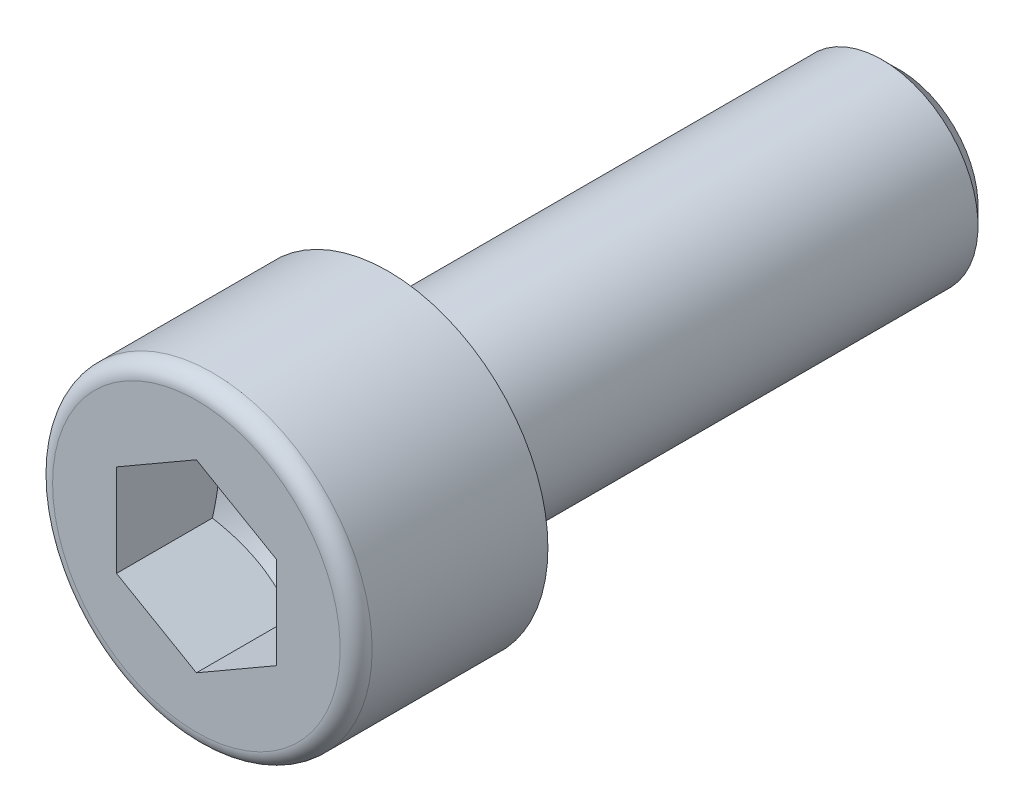
ISO-10303-21;
HEADER;
FILE_DESCRIPTION(('STEP AP214'),'2;1');
FILE_NAME('part.step','',(''),(''),'','','');
FILE_SCHEMA(('AUTOMOTIVE_DESIGN { 1 0 10303 214 1 1 1 1 }'));
ENDSEC;
DATA;
#1=APPLICATION_CONTEXT('core data for automotive mechanical design processes');
#2=APPLICATION_PROTOCOL_DEFINITION('international standard','automotive_design',2000,#1);
#3=PRODUCT_CONTEXT('',#1,'mechanical');
#4=PRODUCT('Part','Part','',(#3));
#5=PRODUCT_RELATED_PRODUCT_CATEGORY('part','',(#4));
#6=PRODUCT_DEFINITION_FORMATION('','',#4);
#7=PRODUCT_DEFINITION_CONTEXT('part definition',#1,'design');
#8=PRODUCT_DEFINITION('design','',#6,#7);
#9=PRODUCT_DEFINITION_SHAPE('','',#8);
#10=(LENGTH_UNIT() NAMED_UNIT(*) SI_UNIT(.MILLI.,.METRE.));
#11=(NAMED_UNIT(*) PLANE_ANGLE_UNIT() SI_UNIT($,.RADIAN.));
#12=(NAMED_UNIT(*) SI_UNIT($,.STERADIAN.) SOLID_ANGLE_UNIT());
#13=UNCERTAINTY_MEASURE_WITH_UNIT(LENGTH_MEASURE(1.E-05),#10,'distance_accuracy_value','');
#14=(GEOMETRIC_REPRESENTATION_CONTEXT(3) GLOBAL_UNCERTAINTY_ASSIGNED_CONTEXT((#13)) GLOBAL_UNIT_ASSIGNED_CONTEXT((#10,
#11,#12)) REPRESENTATION_CONTEXT('',''));
#15=CARTESIAN_POINT('',(0.,0.,0.));
#16=DIRECTION('',(0.,0.,1.));
#17=DIRECTION('',(1.,0.,0.));
#18=AXIS2_PLACEMENT_3D('',#15,#16,#17);
#19=CARTESIAN_POINT('',(-2.5,0.,0.));
#20=DIRECTION('',(0.,0.,-1.));
#21=DIRECTION('',(-1.,0.,0.));
#22=AXIS2_PLACEMENT_3D('',#19,#20,#21);
#23=PLANE('',#22);
#24=CARTESIAN_POINT('',(0.,0.,0.));
#25=DIRECTION('',(0.,0.,-1.));
#26=DIRECTION('',(-1.,0.,0.));
#27=AXIS2_PLACEMENT_3D('',#24,#25,#26);
#28=CIRCLE('',#27,5.);
#29=CARTESIAN_POINT('',(-5.,0.,0.));
#30=VERTEX_POINT('',#29);
#31=EDGE_CURVE('E11',#30,#30,#28,.T.);
#32=ORIENTED_EDGE('',*,*,#31,.T.);
#33=EDGE_LOOP('',(#32));
#34=FACE_BOUND('',#33,.T.);
#35=CARTESIAN_POINT('',(0.,0.,0.));
#36=DIRECTION('',(0.,0.,1.));
#37=DIRECTION('',(-1.,0.,0.));
#38=AXIS2_PLACEMENT_3D('',#35,#36,#37);
#39=CIRCLE('',#38,3.);
#40=CARTESIAN_POINT('',(3.,0.,0.));
#41=VERTEX_POINT('',#40);
#42=EDGE_CURVE('E142',#41,#41,#39,.T.);
#43=ORIENTED_EDGE('',*,*,#42,.T.);
#44=EDGE_LOOP('',(#43));
#45=FACE_BOUND('',#44,.T.);
#46=ADVANCED_FACE('F16',(#34,#45),#23,.T.);
#47=CARTESIAN_POINT('',(0.,0.,2.75));
#48=DIRECTION('',(0.,0.,1.));
#49=DIRECTION('',(-1.,0.,0.));
#50=AXIS2_PLACEMENT_3D('',#47,#48,#49);
#51=CYLINDRICAL_SURFACE('',#50,5.);
#52=CARTESIAN_POINT('',(0.,0.,5.5));
#53=DIRECTION('',(0.,0.,-1.));
#54=DIRECTION('',(-1.,0.,0.));
#55=AXIS2_PLACEMENT_3D('',#52,#53,#54);
#56=CIRCLE('',#55,5.);
#57=CARTESIAN_POINT('',(-5.,0.,5.5));
#58=VERTEX_POINT('',#57);
#59=EDGE_CURVE('E26',#58,#58,#56,.T.);
#60=ORIENTED_EDGE('',*,*,#59,.T.);
#61=EDGE_LOOP('',(#60));
#62=FACE_BOUND('',#61,.T.);
#63=ORIENTED_EDGE('',*,*,#31,.F.);
#64=EDGE_LOOP('',(#63));
#65=FACE_BOUND('',#64,.T.);
#66=ADVANCED_FACE('F18',(#62,#65),#51,.T.);
#67=CARTESIAN_POINT('',(0.,0.,5.5));
#68=DIRECTION('',(0.,0.,-1.));
#69=DIRECTION('',(0.,-1.,0.));
#70=AXIS2_PLACEMENT_3D('',#67,#68,#69);
#71=TOROIDAL_SURFACE('',#70,4.5,0.5);
#72=CARTESIAN_POINT('',(0.,0.,6.));
#73=DIRECTION('',(0.,0.,-1.));
#74=DIRECTION('',(-1.,0.,0.));
#75=AXIS2_PLACEMENT_3D('',#72,#73,#74);
#76=CIRCLE('',#75,4.5);
#77=CARTESIAN_POINT('',(-4.5,0.,6.));
#78=VERTEX_POINT('',#77);
#79=EDGE_CURVE('E141',#78,#78,#76,.T.);
#80=ORIENTED_EDGE('',*,*,#79,.T.);
#81=EDGE_LOOP('',(#80));
#82=FACE_BOUND('',#81,.T.);
#83=ORIENTED_EDGE('',*,*,#59,.F.);
#84=EDGE_LOOP('',(#83));
#85=FACE_BOUND('',#84,.T.);
#86=ADVANCED_FACE('F207',(#82,#85),#71,.T.);
#87=CARTESIAN_POINT('',(-2.25,0.,6.));
#88=DIRECTION('',(0.,0.,1.));
#89=DIRECTION('',(1.,0.,0.));
#90=AXIS2_PLACEMENT_3D('',#87,#88,#89);
#91=PLANE('',#90);
#92=ORIENTED_EDGE('',*,*,#79,.F.);
#93=EDGE_LOOP('',(#92));
#94=FACE_BOUND('',#93,.T.);
#95=DIRECTION('',(-0.866025403784439,-0.5,0.));
#96=VECTOR('',#95,1.);
#97=CARTESIAN_POINT('',(0.406249417187364,-2.65220178962874,6.));
#98=LINE('',#97,#96);
#99=CARTESIAN_POINT('',(2.49999883437473,-1.443375,6.));
#100=VERTEX_POINT('',#99);
#101=CARTESIAN_POINT('',(0.,-2.88675,6.));
#102=VERTEX_POINT('',#101);
#103=EDGE_CURVE('E109',#100,#102,#98,.T.);
#104=ORIENTED_EDGE('',*,*,#103,.T.);
#105=DIRECTION('',(-0.866025403784439,0.5,0.));
#106=VECTOR('',#105,1.);
#107=CARTESIAN_POINT('',(-2.09374941718736,-1.67792321037125,6.));
#108=LINE('',#107,#106);
#109=CARTESIAN_POINT('',(-2.49999883437473,-1.443375,6.));
#110=VERTEX_POINT('',#109);
#111=EDGE_CURVE('E146',#102,#110,#108,.T.);
#112=ORIENTED_EDGE('',*,*,#111,.T.);
#113=DIRECTION('',(0.,1.,0.));
#114=VECTOR('',#113,1.);
#115=CARTESIAN_POINT('',(-2.49999883437473,0.,6.));
#116=LINE('',#115,#114);
#117=CARTESIAN_POINT('',(-2.49999883437473,1.443375,6.));
#118=VERTEX_POINT('',#117);
#119=EDGE_CURVE('E143',#110,#118,#116,.T.);
#120=ORIENTED_EDGE('',*,*,#119,.T.);
#121=DIRECTION('',(0.866025403784439,0.5,0.));
#122=VECTOR('',#121,1.);
#123=CARTESIAN_POINT('',(-2.09374941718736,1.67792321037125,6.));
#124=LINE('',#123,#122);
#125=CARTESIAN_POINT('',(0.,2.88675,6.));
#126=VERTEX_POINT('',#125);
#127=EDGE_CURVE('E91',#118,#126,#124,.T.);
#128=ORIENTED_EDGE('',*,*,#127,.T.);
#129=DIRECTION('',(0.866025403784439,-0.5,0.));
#130=VECTOR('',#129,1.);
#131=CARTESIAN_POINT('',(0.406249417187364,2.65220178962874,6.));
#132=LINE('',#131,#130);
#133=CARTESIAN_POINT('',(2.49999883437473,1.443375,6.));
#134=VERTEX_POINT('',#133);
#135=EDGE_CURVE('E83',#126,#134,#132,.T.);
#136=ORIENTED_EDGE('',*,*,#135,.T.);
#137=DIRECTION('',(0.,-1.,0.));
#138=VECTOR('',#137,1.);
#139=CARTESIAN_POINT('',(2.49999883437473,0.,6.));
#140=LINE('',#139,#138);
#141=EDGE_CURVE('E88',#134,#100,#140,.T.);
#142=ORIENTED_EDGE('',*,*,#141,.T.);
#143=EDGE_LOOP('',(#104,#112,#120,#128,#136,#142));
#144=FACE_BOUND('',#143,.T.);
#145=ADVANCED_FACE('F86',(#94,#144),#91,.T.);
#146=CARTESIAN_POINT('',(-1.229375,0.,-16.));
#147=DIRECTION('',(0.,0.,-1.));
#148=DIRECTION('',(-1.,0.,0.));
#149=AXIS2_PLACEMENT_3D('',#146,#147,#148);
#150=PLANE('',#149);
#151=CARTESIAN_POINT('',(0.,0.,-16.));
#152=DIRECTION('',(0.,0.,-1.));
#153=DIRECTION('',(-1.,0.,0.));
#154=AXIS2_PLACEMENT_3D('',#151,#152,#153);
#155=CIRCLE('',#154,2.45875);
#156=CARTESIAN_POINT('',(-2.45875,0.,-16.));
#157=VERTEX_POINT('',#156);
#158=EDGE_CURVE('E136',#157,#157,#155,.T.);
#159=ORIENTED_EDGE('',*,*,#158,.T.);
#160=EDGE_LOOP('',(#159));
#161=FACE_BOUND('',#160,.T.);
#162=ADVANCED_FACE('F221',(#161),#150,.T.);
#163=CARTESIAN_POINT('',(0.,0.,-15.729375));
#164=DIRECTION('',(0.,0.,1.));
#165=DIRECTION('',(-1.,0.,0.));
#166=AXIS2_PLACEMENT_3D('',#163,#164,#165);
#167=CONICAL_SURFACE('',#166,2.729375,0.785398163397448);
#168=CARTESIAN_POINT('',(0.,0.,-15.45875));
#169=DIRECTION('',(0.,0.,-1.));
#170=DIRECTION('',(-1.,0.,0.));
#171=AXIS2_PLACEMENT_3D('',#168,#169,#170);
#172=CIRCLE('',#171,3.);
#173=CARTESIAN_POINT('',(-3.,0.,-15.45875));
#174=VERTEX_POINT('',#173);
#175=EDGE_CURVE('E20',#174,#174,#172,.T.);
#176=ORIENTED_EDGE('',*,*,#175,.T.);
#177=EDGE_LOOP('',(#176));
#178=FACE_BOUND('',#177,.T.);
#179=ORIENTED_EDGE('',*,*,#158,.F.);
#180=EDGE_LOOP('',(#179));
#181=FACE_BOUND('',#180,.T.);
#182=ADVANCED_FACE('F215',(#178,#181),#167,.T.);
#183=CARTESIAN_POINT('',(0.,0.,-7.229375));
#184=DIRECTION('',(0.,0.,1.));
#185=DIRECTION('',(-1.,0.,0.));
#186=AXIS2_PLACEMENT_3D('',#183,#184,#185);
#187=CYLINDRICAL_SURFACE('',#186,3.);
#188=ORIENTED_EDGE('',*,*,#42,.F.);
#189=EDGE_LOOP('',(#188));
#190=FACE_BOUND('',#189,.T.);
#191=ORIENTED_EDGE('',*,*,#175,.F.);
#192=EDGE_LOOP('',(#191));
#193=FACE_BOUND('',#192,.T.);
#194=ADVANCED_FACE('F212',(#190,#193),#187,.T.);
#195=CARTESIAN_POINT('',(-1.24999941718736,-2.1650625,6.));
#196=DIRECTION('',(-0.5,-0.866025403784439,0.));
#197=DIRECTION('',(-0.866025403784439,0.5,0.));
#198=AXIS2_PLACEMENT_3D('',#195,#196,#197);
#199=PLANE('',#198);
#200=CARTESIAN_POINT('',(0.,-2.88675,3.));
#201=CARTESIAN_POINT('',(-1.24999941718736,-2.1650625,2.58333352760422));
#202=CARTESIAN_POINT('',(-2.49999883437473,-1.443375,3.));
#203=(BOUNDED_CURVE() B_SPLINE_CURVE(2,(#200,#201,#202),.UNSPECIFIED.,.F.,
.F.) B_SPLINE_CURVE_WITH_KNOTS((3,3),(0.,2.92108898323611),
.UNSPECIFIED.) CURVE() GEOMETRIC_REPRESENTATION_ITEM() RATIONAL_B_SPLINE_CURVE((1.,
1.15470053837925,1.)) REPRESENTATION_ITEM(''));
#204=CARTESIAN_POINT('',(0.,-2.88675,3.));
#205=VERTEX_POINT('',#204);
#206=CARTESIAN_POINT('',(-2.49999883437473,-1.443375,3.));
#207=VERTEX_POINT('',#206);
#208=EDGE_CURVE('E118',#205,#207,#203,.T.);
#209=ORIENTED_EDGE('',*,*,#208,.T.);
#210=DIRECTION('',(0.,0.,-1.));
#211=VECTOR('',#210,1.);
#212=CARTESIAN_POINT('',(-2.49999883437473,-1.443375,6.));
#213=LINE('',#212,#211);
#214=EDGE_CURVE('E144',#110,#207,#213,.T.);
#215=ORIENTED_EDGE('',*,*,#214,.F.);
#216=ORIENTED_EDGE('',*,*,#111,.F.);
#217=DIRECTION('',(0.,0.,-1.));
#218=VECTOR('',#217,1.);
#219=CARTESIAN_POINT('',(0.,-2.88675,6.));
#220=LINE('',#219,#218);
#221=EDGE_CURVE('E159',#102,#205,#220,.T.);
#222=ORIENTED_EDGE('',*,*,#221,.T.);
#223=EDGE_LOOP('',(#209,#215,#216,#222));
#224=FACE_BOUND('',#223,.T.);
#225=ADVANCED_FACE('F188',(#224),#199,.F.);
#226=CARTESIAN_POINT('',(-2.49999883437473,0.,6.));
#227=DIRECTION('',(-1.,0.,0.));
#228=DIRECTION('',(0.,1.,0.));
#229=AXIS2_PLACEMENT_3D('',#226,#227,#228);
#230=PLANE('',#229);
#231=CARTESIAN_POINT('',(-2.49999883437473,-1.443375,3.));
#232=CARTESIAN_POINT('',(-2.49999883437473,0.,2.58333352760421));
#233=CARTESIAN_POINT('',(-2.49999883437473,1.443375,3.));
#234=(BOUNDED_CURVE() B_SPLINE_CURVE(2,(#231,#232,#233),.UNSPECIFIED.,.F.,
.F.) B_SPLINE_CURVE_WITH_KNOTS((3,3),(0.,2.92108898323611),
.UNSPECIFIED.) CURVE() GEOMETRIC_REPRESENTATION_ITEM() RATIONAL_B_SPLINE_CURVE((1.,
1.15470053837925,1.)) REPRESENTATION_ITEM(''));
#235=CARTESIAN_POINT('',(-2.49999883437473,1.443375,3.));
#236=VERTEX_POINT('',#235);
#237=EDGE_CURVE('E113',#207,#236,#234,.T.);
#238=ORIENTED_EDGE('',*,*,#237,.T.);
#239=DIRECTION('',(0.,0.,-1.));
#240=VECTOR('',#239,1.);
#241=CARTESIAN_POINT('',(-2.49999883437473,1.443375,6.));
#242=LINE('',#241,#240);
#243=EDGE_CURVE('E145',#118,#236,#242,.T.);
#244=ORIENTED_EDGE('',*,*,#243,.F.);
#245=ORIENTED_EDGE('',*,*,#119,.F.);
#246=ORIENTED_EDGE('',*,*,#214,.T.);
#247=EDGE_LOOP('',(#238,#244,#245,#246));
#248=FACE_BOUND('',#247,.T.);
#249=ADVANCED_FACE('F190',(#248),#230,.F.);
#250=CARTESIAN_POINT('',(-1.24999941718736,2.1650625,6.));
#251=DIRECTION('',(-0.5,0.866025403784439,0.));
#252=DIRECTION('',(0.866025403784439,0.5,0.));
#253=AXIS2_PLACEMENT_3D('',#250,#251,#252);
#254=PLANE('',#253);
#255=CARTESIAN_POINT('',(-2.49999883437473,1.443375,3.));
#256=CARTESIAN_POINT('',(-1.24999941718736,2.1650625,2.58333352760421));
#257=CARTESIAN_POINT('',(0.,2.88675,3.));
#258=(BOUNDED_CURVE() B_SPLINE_CURVE(2,(#255,#256,#257),.UNSPECIFIED.,.F.,
.F.) B_SPLINE_CURVE_WITH_KNOTS((3,3),(0.,2.9210889832361),
.UNSPECIFIED.) CURVE() GEOMETRIC_REPRESENTATION_ITEM() RATIONAL_B_SPLINE_CURVE((1.,
1.15470053837926,1.)) REPRESENTATION_ITEM(''));
#259=CARTESIAN_POINT('',(0.,2.88675,3.));
#260=VERTEX_POINT('',#259);
#261=EDGE_CURVE('E119',#236,#260,#258,.T.);
#262=ORIENTED_EDGE('',*,*,#261,.T.);
#263=DIRECTION('',(0.,0.,-1.));
#264=VECTOR('',#263,1.);
#265=CARTESIAN_POINT('',(0.,2.88675,6.));
#266=LINE('',#265,#264);
#267=EDGE_CURVE('E94',#126,#260,#266,.T.);
#268=ORIENTED_EDGE('',*,*,#267,.F.);
#269=ORIENTED_EDGE('',*,*,#127,.F.);
#270=ORIENTED_EDGE('',*,*,#243,.T.);
#271=EDGE_LOOP('',(#262,#268,#269,#270));
#272=FACE_BOUND('',#271,.T.);
#273=ADVANCED_FACE('F192',(#272),#254,.F.);
#274=CARTESIAN_POINT('',(1.24999941718736,2.1650625,6.));
#275=DIRECTION('',(0.5,0.866025403784439,0.));
#276=DIRECTION('',(0.866025403784439,-0.5,0.));
#277=AXIS2_PLACEMENT_3D('',#274,#275,#276);
#278=PLANE('',#277);
#279=CARTESIAN_POINT('',(0.,2.88675,3.));
#280=CARTESIAN_POINT('',(1.24999941718736,2.1650625,2.58333352760421));
#281=CARTESIAN_POINT('',(2.49999883437473,1.443375,3.));
#282=(BOUNDED_CURVE() B_SPLINE_CURVE(2,(#279,#280,#281),.UNSPECIFIED.,.F.,
.F.) B_SPLINE_CURVE_WITH_KNOTS((3,3),(0.,2.9210889832361),
.UNSPECIFIED.) CURVE() GEOMETRIC_REPRESENTATION_ITEM() RATIONAL_B_SPLINE_CURVE((1.,
1.15470053837926,1.)) REPRESENTATION_ITEM(''));
#283=CARTESIAN_POINT('',(2.49999883437473,1.443375,3.));
#284=VERTEX_POINT('',#283);
#285=EDGE_CURVE('E100',#260,#284,#282,.T.);
#286=ORIENTED_EDGE('',*,*,#285,.T.);
#287=DIRECTION('',(0.,0.,-1.));
#288=VECTOR('',#287,1.);
#289=CARTESIAN_POINT('',(2.49999883437473,1.443375,6.));
#290=LINE('',#289,#288);
#291=EDGE_CURVE('E95',#134,#284,#290,.T.);
#292=ORIENTED_EDGE('',*,*,#291,.F.);
#293=ORIENTED_EDGE('',*,*,#135,.F.);
#294=ORIENTED_EDGE('',*,*,#267,.T.);
#295=EDGE_LOOP('',(#286,#292,#293,#294));
#296=FACE_BOUND('',#295,.T.);
#297=ADVANCED_FACE('F98',(#296),#278,.F.);
#298=CARTESIAN_POINT('',(2.49999883437473,0.,6.));
#299=DIRECTION('',(1.,0.,0.));
#300=DIRECTION('',(0.,-1.,0.));
#301=AXIS2_PLACEMENT_3D('',#298,#299,#300);
#302=PLANE('',#301);
#303=CARTESIAN_POINT('',(2.49999883437473,1.443375,3.));
#304=CARTESIAN_POINT('',(2.49999883437473,0.,2.58333352760421));
#305=CARTESIAN_POINT('',(2.49999883437473,-1.443375,3.));
#306=(BOUNDED_CURVE() B_SPLINE_CURVE(2,(#303,#304,#305),.UNSPECIFIED.,.F.,
.F.) B_SPLINE_CURVE_WITH_KNOTS((3,3),(0.,2.92108898323611),
.UNSPECIFIED.) CURVE() GEOMETRIC_REPRESENTATION_ITEM() RATIONAL_B_SPLINE_CURVE((1.,
1.15470053837925,1.)) REPRESENTATION_ITEM(''));
#307=CARTESIAN_POINT('',(2.49999883437473,-1.443375,3.));
#308=VERTEX_POINT('',#307);
#309=EDGE_CURVE('E135',#284,#308,#306,.T.);
#310=ORIENTED_EDGE('',*,*,#309,.T.);
#311=DIRECTION('',(0.,0.,-1.));
#312=VECTOR('',#311,1.);
#313=CARTESIAN_POINT('',(2.49999883437473,-1.443375,6.));
#314=LINE('',#313,#312);
#315=EDGE_CURVE('E106',#100,#308,#314,.T.);
#316=ORIENTED_EDGE('',*,*,#315,.F.);
#317=ORIENTED_EDGE('',*,*,#141,.F.);
#318=ORIENTED_EDGE('',*,*,#291,.T.);
#319=EDGE_LOOP('',(#310,#316,#317,#318));
#320=FACE_BOUND('',#319,.T.);
#321=ADVANCED_FACE('F105',(#320),#302,.F.);
#322=CARTESIAN_POINT('',(1.24999941718736,-2.1650625,6.));
#323=DIRECTION('',(0.5,-0.866025403784439,0.));
#324=DIRECTION('',(-0.866025403784439,-0.5,0.));
#325=AXIS2_PLACEMENT_3D('',#322,#323,#324);
#326=PLANE('',#325);
#327=CARTESIAN_POINT('',(2.49999883437473,-1.443375,3.));
#328=CARTESIAN_POINT('',(1.24999941718737,-2.1650625,2.58333352760422));
#329=CARTESIAN_POINT('',(0.,-2.88675,3.));
#330=(BOUNDED_CURVE() B_SPLINE_CURVE(2,(#327,#328,#329),.UNSPECIFIED.,.F.,
.F.) B_SPLINE_CURVE_WITH_KNOTS((3,3),(0.,2.92108898323611),
.UNSPECIFIED.) CURVE() GEOMETRIC_REPRESENTATION_ITEM() RATIONAL_B_SPLINE_CURVE((1.,
1.15470053837925,1.)) REPRESENTATION_ITEM(''));
#331=EDGE_CURVE('E127',#308,#205,#330,.T.);
#332=ORIENTED_EDGE('',*,*,#331,.T.);
#333=ORIENTED_EDGE('',*,*,#221,.F.);
#334=ORIENTED_EDGE('',*,*,#103,.F.);
#335=ORIENTED_EDGE('',*,*,#315,.T.);
#336=EDGE_LOOP('',(#332,#333,#334,#335));
#337=FACE_BOUND('',#336,.T.);
#338=ADVANCED_FACE('F186',(#337),#326,.F.);
#339=CARTESIAN_POINT('',(0.,0.,2.16666705520842));
#340=DIRECTION('',(0.,0.,1.));
#341=DIRECTION('',(-1.,0.,0.));
#342=AXIS2_PLACEMENT_3D('',#339,#340,#341);
#343=CONICAL_SURFACE('',#342,1.443375,1.0471975511966);
#344=CARTESIAN_POINT('',(0.,0.,1.33333411041685));
#345=VERTEX_POINT('',#344);
#346=VERTEX_LOOP('',#345);
#347=FACE_BOUND('',#346,.T.);
#348=ORIENTED_EDGE('',*,*,#261,.F.);
#349=ORIENTED_EDGE('',*,*,#237,.F.);
#350=ORIENTED_EDGE('',*,*,#208,.F.);
#351=ORIENTED_EDGE('',*,*,#331,.F.);
#352=ORIENTED_EDGE('',*,*,#309,.F.);
#353=ORIENTED_EDGE('',*,*,#285,.F.);
#354=EDGE_LOOP('',(#348,#349,#350,#351,#352,#353));
#355=FACE_BOUND('',#354,.T.);
#356=ADVANCED_FACE('F182',(#347,#355),#343,.F.);
#357=CLOSED_SHELL('',(#46,#66,#86,#145,#162,#182,#194,#225,#249,#273,#297,#321,#338,#356));
#358=MANIFOLD_SOLID_BREP('B1',#357);
#359=ADVANCED_BREP_SHAPE_REPRESENTATION('',(#18,#358),#14);
#360=SHAPE_DEFINITION_REPRESENTATION(#9,#359);
ENDSEC;
END-ISO-10303-21;
